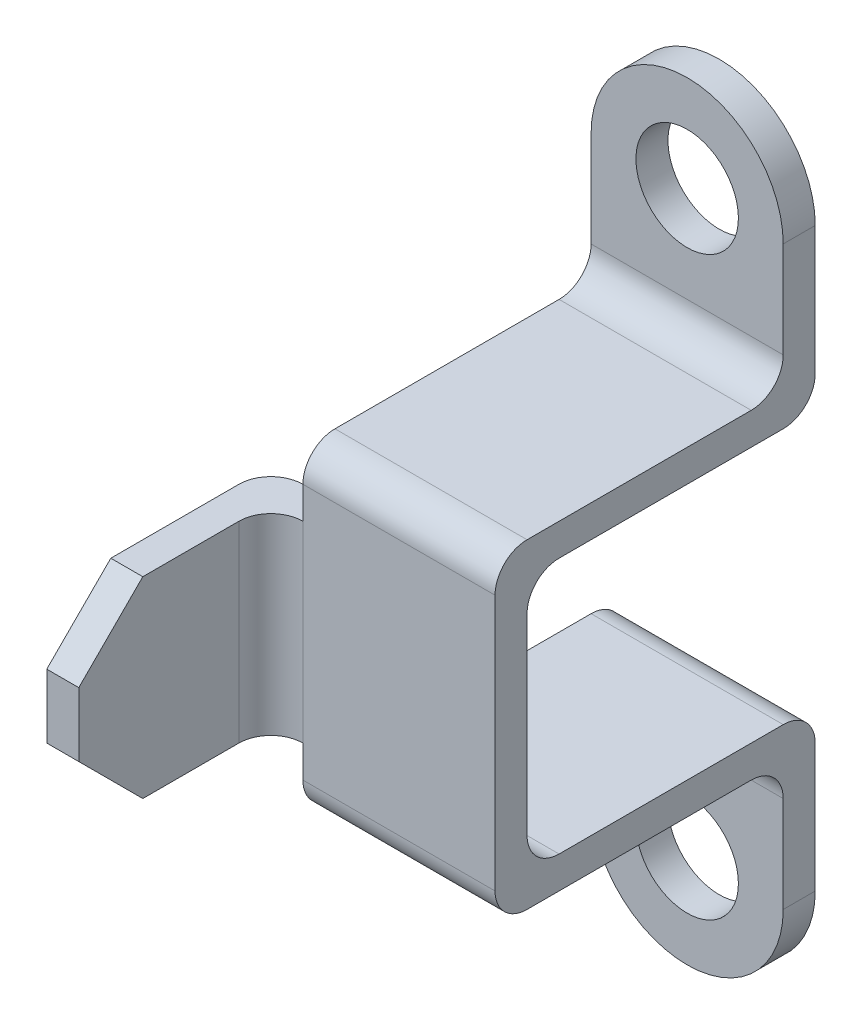
ISO-10303-21;
HEADER;
FILE_DESCRIPTION(('STEP AP214'),'2;1');
FILE_NAME('part.step','',(''),(''),'','','');
FILE_SCHEMA(('AUTOMOTIVE_DESIGN { 1 0 10303 214 1 1 1 1 }'));
ENDSEC;
DATA;
#1=APPLICATION_CONTEXT('core data for automotive mechanical design processes');
#2=APPLICATION_PROTOCOL_DEFINITION('international standard','automotive_design',2000,#1);
#3=PRODUCT_CONTEXT('',#1,'mechanical');
#4=PRODUCT('Part','Part','',(#3));
#5=PRODUCT_RELATED_PRODUCT_CATEGORY('part','',(#4));
#6=PRODUCT_DEFINITION_FORMATION('','',#4);
#7=PRODUCT_DEFINITION_CONTEXT('part definition',#1,'design');
#8=PRODUCT_DEFINITION('design','',#6,#7);
#9=PRODUCT_DEFINITION_SHAPE('','',#8);
#10=(LENGTH_UNIT() NAMED_UNIT(*) SI_UNIT(.MILLI.,.METRE.));
#11=(NAMED_UNIT(*) PLANE_ANGLE_UNIT() SI_UNIT($,.RADIAN.));
#12=(NAMED_UNIT(*) SI_UNIT($,.STERADIAN.) SOLID_ANGLE_UNIT());
#13=UNCERTAINTY_MEASURE_WITH_UNIT(LENGTH_MEASURE(1.E-05),#10,'distance_accuracy_value','');
#14=(GEOMETRIC_REPRESENTATION_CONTEXT(3) GLOBAL_UNCERTAINTY_ASSIGNED_CONTEXT((#13)) GLOBAL_UNIT_ASSIGNED_CONTEXT((#10,
#11,#12)) REPRESENTATION_CONTEXT('',''));
#15=CARTESIAN_POINT('',(0.,0.,0.));
#16=DIRECTION('',(0.,0.,1.));
#17=DIRECTION('',(1.,0.,0.));
#18=AXIS2_PLACEMENT_3D('',#15,#16,#17);
#19=CARTESIAN_POINT('',(-15.,0.,0.));
#20=DIRECTION('',(1.,0.,0.));
#21=DIRECTION('',(0.,0.,-1.));
#22=AXIS2_PLACEMENT_3D('',#19,#20,#21);
#23=PLANE('',#22);
#24=DIRECTION('',(0.,0.,-1.));
#25=VECTOR('',#24,1.);
#26=CARTESIAN_POINT('',(-15.,15.,50.));
#27=LINE('',#26,#25);
#28=CARTESIAN_POINT('',(-15.,15.,50.));
#29=VERTEX_POINT('',#28);
#30=CARTESIAN_POINT('',(-15.,15.,45.));
#31=VERTEX_POINT('',#30);
#32=EDGE_CURVE('E348',#29,#31,#27,.T.);
#33=ORIENTED_EDGE('',*,*,#32,.F.);
#34=DIRECTION('',(0.,-1.,0.));
#35=VECTOR('',#34,1.);
#36=CARTESIAN_POINT('',(-15.,25.,50.));
#37=LINE('',#36,#35);
#38=CARTESIAN_POINT('',(-15.,20.,50.));
#39=VERTEX_POINT('',#38);
#40=EDGE_CURVE('E389',#39,#29,#37,.T.);
#41=ORIENTED_EDGE('',*,*,#40,.F.);
#42=CARTESIAN_POINT('',(-15.,20.,45.));
#43=DIRECTION('',(1.,0.,0.));
#44=DIRECTION('',(0.,0.,-1.));
#45=AXIS2_PLACEMENT_3D('',#42,#43,#44);
#46=CIRCLE('',#45,5.);
#47=CARTESIAN_POINT('',(-15.,25.,45.));
#48=VERTEX_POINT('',#47);
#49=EDGE_CURVE('E414',#39,#48,#46,.F.);
#50=ORIENTED_EDGE('',*,*,#49,.T.);
#51=DIRECTION('',(0.,0.,1.));
#52=VECTOR('',#51,1.);
#53=CARTESIAN_POINT('',(-15.,25.,5.));
#54=LINE('',#53,#52);
#55=CARTESIAN_POINT('',(-15.,25.,10.));
#56=VERTEX_POINT('',#55);
#57=EDGE_CURVE('E386',#56,#48,#54,.T.);
#58=ORIENTED_EDGE('',*,*,#57,.F.);
#59=CARTESIAN_POINT('',(-15.,30.,10.));
#60=DIRECTION('',(1.,0.,0.));
#61=DIRECTION('',(0.,0.,-1.));
#62=AXIS2_PLACEMENT_3D('',#59,#60,#61);
#63=CIRCLE('',#62,5.);
#64=CARTESIAN_POINT('',(-15.,30.,5.));
#65=VERTEX_POINT('',#64);
#66=EDGE_CURVE('E398',#56,#65,#63,.T.);
#67=ORIENTED_EDGE('',*,*,#66,.T.);
#68=DIRECTION('',(0.,-1.,0.));
#69=VECTOR('',#68,1.);
#70=CARTESIAN_POINT('',(-15.,45.,5.));
#71=LINE('',#70,#69);
#72=CARTESIAN_POINT('',(-15.,45.,4.99999999999999));
#73=VERTEX_POINT('',#72);
#74=EDGE_CURVE('E383',#73,#65,#71,.T.);
#75=ORIENTED_EDGE('',*,*,#74,.F.);
#76=DIRECTION('',(0.,0.,1.));
#77=VECTOR('',#76,1.);
#78=CARTESIAN_POINT('',(-15.,45.,0.));
#79=LINE('',#78,#77);
#80=CARTESIAN_POINT('',(-15.,45.,0.));
#81=VERTEX_POINT('',#80);
#82=EDGE_CURVE('E381',#81,#73,#79,.T.);
#83=ORIENTED_EDGE('',*,*,#82,.F.);
#84=DIRECTION('',(0.,1.,0.));
#85=VECTOR('',#84,1.);
#86=CARTESIAN_POINT('',(-15.,20.,0.));
#87=LINE('',#86,#85);
#88=CARTESIAN_POINT('',(-15.,25.,0.));
#89=VERTEX_POINT('',#88);
#90=EDGE_CURVE('E356',#89,#81,#87,.T.);
#91=ORIENTED_EDGE('',*,*,#90,.F.);
#92=CARTESIAN_POINT('',(-15.,25.,5.));
#93=DIRECTION('',(1.,0.,0.));
#94=DIRECTION('',(0.,0.,-1.));
#95=AXIS2_PLACEMENT_3D('',#92,#93,#94);
#96=CIRCLE('',#95,5.);
#97=CARTESIAN_POINT('',(-15.,20.,5.00000000000001));
#98=VERTEX_POINT('',#97);
#99=EDGE_CURVE('E412',#89,#98,#96,.F.);
#100=ORIENTED_EDGE('',*,*,#99,.T.);
#101=DIRECTION('',(0.,0.,-1.));
#102=VECTOR('',#101,1.);
#103=CARTESIAN_POINT('',(-15.,20.,45.));
#104=LINE('',#103,#102);
#105=CARTESIAN_POINT('',(-15.,20.,40.));
#106=VERTEX_POINT('',#105);
#107=EDGE_CURVE('E361',#106,#98,#104,.T.);
#108=ORIENTED_EDGE('',*,*,#107,.F.);
#109=CARTESIAN_POINT('',(-15.,15.,40.));
#110=DIRECTION('',(1.,0.,0.));
#111=DIRECTION('',(0.,0.,-1.));
#112=AXIS2_PLACEMENT_3D('',#109,#110,#111);
#113=CIRCLE('',#112,5.);
#114=EDGE_CURVE('E425',#106,#31,#113,.T.);
#115=ORIENTED_EDGE('',*,*,#114,.T.);
#116=EDGE_LOOP('',(#33,#41,#50,#58,#67,#75,#83,#91,#100,#108,#115));
#117=FACE_BOUND('',#116,.T.);
#118=ADVANCED_FACE('F45',(#117),#23,.F.);
#119=CARTESIAN_POINT('',(15.,20.,0.));
#120=DIRECTION('',(0.,0.,1.));
#121=DIRECTION('',(1.,0.,0.));
#122=AXIS2_PLACEMENT_3D('',#119,#120,#121);
#123=PLANE('',#122);
#124=CARTESIAN_POINT('',(0.,45.,0.));
#125=DIRECTION('',(0.,0.,1.));
#126=DIRECTION('',(1.,0.,0.));
#127=AXIS2_PLACEMENT_3D('',#124,#125,#126);
#128=CIRCLE('',#127,8.);
#129=CARTESIAN_POINT('',(8.,45.,0.));
#130=VERTEX_POINT('',#129);
#131=EDGE_CURVE('E332',#130,#130,#128,.T.);
#132=ORIENTED_EDGE('',*,*,#131,.T.);
#133=EDGE_LOOP('',(#132));
#134=FACE_BOUND('',#133,.T.);
#135=DIRECTION('',(0.,1.,0.));
#136=VECTOR('',#135,1.);
#137=CARTESIAN_POINT('',(15.,20.,0.));
#138=LINE('',#137,#136);
#139=CARTESIAN_POINT('',(15.,25.,0.));
#140=VERTEX_POINT('',#139);
#141=CARTESIAN_POINT('',(15.,45.,0.));
#142=VERTEX_POINT('',#141);
#143=EDGE_CURVE('E357',#140,#142,#138,.T.);
#144=ORIENTED_EDGE('',*,*,#143,.F.);
#145=DIRECTION('',(-1.,0.,0.));
#146=VECTOR('',#145,1.);
#147=CARTESIAN_POINT('',(15.,25.,0.));
#148=LINE('',#147,#146);
#149=EDGE_CURVE('E422',#140,#89,#148,.T.);
#150=ORIENTED_EDGE('',*,*,#149,.T.);
#151=ORIENTED_EDGE('',*,*,#90,.T.);
#152=CARTESIAN_POINT('',(0.,45.,0.));
#153=DIRECTION('',(0.,0.,1.));
#154=DIRECTION('',(-1.,0.,0.));
#155=AXIS2_PLACEMENT_3D('',#152,#153,#154);
#156=CIRCLE('',#155,15.);
#157=EDGE_CURVE('E338',#142,#81,#156,.T.);
#158=ORIENTED_EDGE('',*,*,#157,.F.);
#159=EDGE_LOOP('',(#144,#150,#151,#158));
#160=FACE_BOUND('',#159,.T.);
#161=ADVANCED_FACE('F499',(#134,#160),#123,.F.);
#162=CARTESIAN_POINT('',(15.,45.,5.));
#163=DIRECTION('',(0.,0.,-1.));
#164=DIRECTION('',(0.,1.,0.));
#165=AXIS2_PLACEMENT_3D('',#162,#163,#164);
#166=PLANE('',#165);
#167=CARTESIAN_POINT('',(0.,45.,4.99999999999999));
#168=DIRECTION('',(0.,0.,1.));
#169=DIRECTION('',(1.,0.,0.));
#170=AXIS2_PLACEMENT_3D('',#167,#168,#169);
#171=CIRCLE('',#170,8.);
#172=CARTESIAN_POINT('',(8.,45.,4.99999999999999));
#173=VERTEX_POINT('',#172);
#174=EDGE_CURVE('E331',#173,#173,#171,.T.);
#175=ORIENTED_EDGE('',*,*,#174,.F.);
#176=EDGE_LOOP('',(#175));
#177=FACE_BOUND('',#176,.T.);
#178=ORIENTED_EDGE('',*,*,#74,.T.);
#179=DIRECTION('',(-1.,0.,0.));
#180=VECTOR('',#179,1.);
#181=CARTESIAN_POINT('',(15.,30.,5.));
#182=LINE('',#181,#180);
#183=CARTESIAN_POINT('',(15.,30.,5.));
#184=VERTEX_POINT('',#183);
#185=EDGE_CURVE('E396',#65,#184,#182,.F.);
#186=ORIENTED_EDGE('',*,*,#185,.T.);
#187=DIRECTION('',(0.,-1.,0.));
#188=VECTOR('',#187,1.);
#189=CARTESIAN_POINT('',(15.,45.,5.));
#190=LINE('',#189,#188);
#191=CARTESIAN_POINT('',(15.,45.,5.));
#192=VERTEX_POINT('',#191);
#193=EDGE_CURVE('E364',#192,#184,#190,.T.);
#194=ORIENTED_EDGE('',*,*,#193,.F.);
#195=CARTESIAN_POINT('',(0.,45.,4.99999999999999));
#196=DIRECTION('',(0.,0.,1.));
#197=DIRECTION('',(-1.,0.,0.));
#198=AXIS2_PLACEMENT_3D('',#195,#196,#197);
#199=CIRCLE('',#198,15.);
#200=EDGE_CURVE('E335',#192,#73,#199,.T.);
#201=ORIENTED_EDGE('',*,*,#200,.T.);
#202=EDGE_LOOP('',(#178,#186,#194,#201));
#203=FACE_BOUND('',#202,.T.);
#204=ADVANCED_FACE('F488',(#177,#203),#166,.F.);
#205=CARTESIAN_POINT('',(15.,25.,5.));
#206=DIRECTION('',(0.,-1.,0.));
#207=DIRECTION('',(0.,0.,-1.));
#208=AXIS2_PLACEMENT_3D('',#205,#206,#207);
#209=PLANE('',#208);
#210=ORIENTED_EDGE('',*,*,#57,.T.);
#211=DIRECTION('',(-1.,0.,0.));
#212=VECTOR('',#211,1.);
#213=CARTESIAN_POINT('',(15.,25.,45.));
#214=LINE('',#213,#212);
#215=CARTESIAN_POINT('',(15.,25.,45.));
#216=VERTEX_POINT('',#215);
#217=EDGE_CURVE('E416',#48,#216,#214,.F.);
#218=ORIENTED_EDGE('',*,*,#217,.T.);
#219=DIRECTION('',(0.,0.,1.));
#220=VECTOR('',#219,1.);
#221=CARTESIAN_POINT('',(15.,25.,5.));
#222=LINE('',#221,#220);
#223=CARTESIAN_POINT('',(15.,25.,10.));
#224=VERTEX_POINT('',#223);
#225=EDGE_CURVE('E367',#224,#216,#222,.T.);
#226=ORIENTED_EDGE('',*,*,#225,.F.);
#227=DIRECTION('',(-1.,0.,0.));
#228=VECTOR('',#227,1.);
#229=CARTESIAN_POINT('',(-15.,25.,10.));
#230=LINE('',#229,#228);
#231=EDGE_CURVE('E378',#224,#56,#230,.T.);
#232=ORIENTED_EDGE('',*,*,#231,.T.);
#233=EDGE_LOOP('',(#210,#218,#226,#232));
#234=FACE_BOUND('',#233,.T.);
#235=ADVANCED_FACE('F478',(#234),#209,.F.);
#236=CARTESIAN_POINT('',(15.,25.,50.));
#237=DIRECTION('',(0.,0.,-1.));
#238=DIRECTION('',(-1.,0.,0.));
#239=AXIS2_PLACEMENT_3D('',#236,#237,#238);
#240=PLANE('',#239);
#241=ORIENTED_EDGE('',*,*,#40,.T.);
#242=DIRECTION('',(0.,-1.,0.));
#243=VECTOR('',#242,1.);
#244=CARTESIAN_POINT('',(-15.,0.,50.));
#245=LINE('',#244,#243);
#246=CARTESIAN_POINT('',(-15.,-15.,50.));
#247=VERTEX_POINT('',#246);
#248=EDGE_CURVE('E437',#29,#247,#245,.T.);
#249=ORIENTED_EDGE('',*,*,#248,.T.);
#250=DIRECTION('',(0.,1.,0.));
#251=VECTOR('',#250,1.);
#252=CARTESIAN_POINT('',(-15.,-25.,50.));
#253=LINE('',#252,#251);
#254=CARTESIAN_POINT('',(-15.,-20.,50.));
#255=VERTEX_POINT('',#254);
#256=EDGE_CURVE('E270',#255,#247,#253,.T.);
#257=ORIENTED_EDGE('',*,*,#256,.F.);
#258=DIRECTION('',(-1.,0.,0.));
#259=VECTOR('',#258,1.);
#260=CARTESIAN_POINT('',(15.,-20.,50.));
#261=LINE('',#260,#259);
#262=CARTESIAN_POINT('',(15.,-20.,50.));
#263=VERTEX_POINT('',#262);
#264=EDGE_CURVE('E293',#263,#255,#261,.T.);
#265=ORIENTED_EDGE('',*,*,#264,.F.);
#266=DIRECTION('',(0.,-1.,0.));
#267=VECTOR('',#266,1.);
#268=CARTESIAN_POINT('',(15.,25.,50.));
#269=LINE('',#268,#267);
#270=CARTESIAN_POINT('',(15.,20.,50.));
#271=VERTEX_POINT('',#270);
#272=EDGE_CURVE('E370',#271,#263,#269,.T.);
#273=ORIENTED_EDGE('',*,*,#272,.F.);
#274=DIRECTION('',(-1.,0.,0.));
#275=VECTOR('',#274,1.);
#276=CARTESIAN_POINT('',(15.,20.,50.));
#277=LINE('',#276,#275);
#278=EDGE_CURVE('E409',#271,#39,#277,.T.);
#279=ORIENTED_EDGE('',*,*,#278,.T.);
#280=EDGE_LOOP('',(#241,#249,#257,#265,#273,#279));
#281=FACE_BOUND('',#280,.T.);
#282=ADVANCED_FACE('F467',(#281),#240,.F.);
#283=CARTESIAN_POINT('',(15.,0.,45.));
#284=DIRECTION('',(0.,0.,1.));
#285=DIRECTION('',(1.,0.,0.));
#286=AXIS2_PLACEMENT_3D('',#283,#284,#285);
#287=PLANE('',#286);
#288=DIRECTION('',(0.,1.,0.));
#289=VECTOR('',#288,1.);
#290=CARTESIAN_POINT('',(15.,0.,45.));
#291=LINE('',#290,#289);
#292=CARTESIAN_POINT('',(15.,-15.,45.));
#293=VERTEX_POINT('',#292);
#294=CARTESIAN_POINT('',(15.,15.,45.));
#295=VERTEX_POINT('',#294);
#296=EDGE_CURVE('E372',#293,#295,#291,.T.);
#297=ORIENTED_EDGE('',*,*,#296,.F.);
#298=DIRECTION('',(-1.,0.,0.));
#299=VECTOR('',#298,1.);
#300=CARTESIAN_POINT('',(15.,-15.,45.));
#301=LINE('',#300,#299);
#302=CARTESIAN_POINT('',(-15.,-15.,45.));
#303=VERTEX_POINT('',#302);
#304=EDGE_CURVE('E290',#303,#293,#301,.F.);
#305=ORIENTED_EDGE('',*,*,#304,.F.);
#306=DIRECTION('',(-1.,0.,0.));
#307=VECTOR('',#306,1.);
#308=CARTESIAN_POINT('',(-15.,-15.,45.));
#309=LINE('',#308,#307);
#310=CARTESIAN_POINT('',(-20.,-15.,45.));
#311=VERTEX_POINT('',#310);
#312=EDGE_CURVE('E257',#303,#311,#309,.T.);
#313=ORIENTED_EDGE('',*,*,#312,.T.);
#314=DIRECTION('',(0.,-1.,0.));
#315=VECTOR('',#314,1.);
#316=CARTESIAN_POINT('',(-20.,15.,45.));
#317=LINE('',#316,#315);
#318=CARTESIAN_POINT('',(-20.,15.,45.));
#319=VERTEX_POINT('',#318);
#320=EDGE_CURVE('E432',#311,#319,#317,.F.);
#321=ORIENTED_EDGE('',*,*,#320,.T.);
#322=DIRECTION('',(-1.,0.,0.));
#323=VECTOR('',#322,1.);
#324=CARTESIAN_POINT('',(-15.,15.,45.));
#325=LINE('',#324,#323);
#326=EDGE_CURVE('E353',#31,#319,#325,.T.);
#327=ORIENTED_EDGE('',*,*,#326,.F.);
#328=DIRECTION('',(-1.,0.,0.));
#329=VECTOR('',#328,1.);
#330=CARTESIAN_POINT('',(15.,15.,45.));
#331=LINE('',#330,#329);
#332=EDGE_CURVE('E407',#31,#295,#331,.F.);
#333=ORIENTED_EDGE('',*,*,#332,.T.);
#334=EDGE_LOOP('',(#297,#305,#313,#321,#327,#333));
#335=FACE_BOUND('',#334,.T.);
#336=ADVANCED_FACE('F512',(#335),#287,.F.);
#337=CARTESIAN_POINT('',(15.,20.,45.));
#338=DIRECTION('',(0.,1.,0.));
#339=DIRECTION('',(0.,0.,1.));
#340=AXIS2_PLACEMENT_3D('',#337,#338,#339);
#341=PLANE('',#340);
#342=DIRECTION('',(0.,0.,-1.));
#343=VECTOR('',#342,1.);
#344=CARTESIAN_POINT('',(15.,20.,45.));
#345=LINE('',#344,#343);
#346=CARTESIAN_POINT('',(15.,20.,40.));
#347=VERTEX_POINT('',#346);
#348=CARTESIAN_POINT('',(15.,20.,5.00000000000001));
#349=VERTEX_POINT('',#348);
#350=EDGE_CURVE('E375',#347,#349,#345,.T.);
#351=ORIENTED_EDGE('',*,*,#350,.F.);
#352=DIRECTION('',(-1.,0.,0.));
#353=VECTOR('',#352,1.);
#354=CARTESIAN_POINT('',(-15.,20.,40.));
#355=LINE('',#354,#353);
#356=EDGE_CURVE('E404',#347,#106,#355,.T.);
#357=ORIENTED_EDGE('',*,*,#356,.T.);
#358=ORIENTED_EDGE('',*,*,#107,.T.);
#359=DIRECTION('',(-1.,0.,0.));
#360=VECTOR('',#359,1.);
#361=CARTESIAN_POINT('',(15.,20.,5.));
#362=LINE('',#361,#360);
#363=EDGE_CURVE('E402',#98,#349,#362,.F.);
#364=ORIENTED_EDGE('',*,*,#363,.T.);
#365=EDGE_LOOP('',(#351,#357,#358,#364));
#366=FACE_BOUND('',#365,.T.);
#367=ADVANCED_FACE('F506',(#366),#341,.F.);
#368=CARTESIAN_POINT('',(15.,0.,0.));
#369=DIRECTION('',(1.,0.,0.));
#370=DIRECTION('',(0.,0.,-1.));
#371=AXIS2_PLACEMENT_3D('',#368,#369,#370);
#372=PLANE('',#371);
#373=ORIENTED_EDGE('',*,*,#225,.T.);
#374=CARTESIAN_POINT('',(15.,20.,45.));
#375=DIRECTION('',(1.,0.,0.));
#376=DIRECTION('',(0.,0.,-1.));
#377=AXIS2_PLACEMENT_3D('',#374,#375,#376);
#378=CIRCLE('',#377,5.);
#379=EDGE_CURVE('E420',#216,#271,#378,.T.);
#380=ORIENTED_EDGE('',*,*,#379,.T.);
#381=ORIENTED_EDGE('',*,*,#272,.T.);
#382=CARTESIAN_POINT('',(15.,-20.,45.));
#383=DIRECTION('',(-1.,0.,0.));
#384=DIRECTION('',(0.,0.,-1.));
#385=AXIS2_PLACEMENT_3D('',#382,#383,#384);
#386=CIRCLE('',#385,5.);
#387=CARTESIAN_POINT('',(15.,-25.,45.));
#388=VERTEX_POINT('',#387);
#389=EDGE_CURVE('E304',#388,#263,#386,.T.);
#390=ORIENTED_EDGE('',*,*,#389,.F.);
#391=DIRECTION('',(0.,0.,1.));
#392=VECTOR('',#391,1.);
#393=CARTESIAN_POINT('',(15.,-25.,4.99999999999999));
#394=LINE('',#393,#392);
#395=CARTESIAN_POINT('',(15.,-25.,9.99999999999999));
#396=VERTEX_POINT('',#395);
#397=EDGE_CURVE('E907',#396,#388,#394,.T.);
#398=ORIENTED_EDGE('',*,*,#397,.F.);
#399=CARTESIAN_POINT('',(15.,-30.,9.99999999999999));
#400=DIRECTION('',(-1.,0.,0.));
#401=DIRECTION('',(0.,0.,-1.));
#402=AXIS2_PLACEMENT_3D('',#399,#400,#401);
#403=CIRCLE('',#402,5.);
#404=CARTESIAN_POINT('',(15.,-30.,4.99999999999999));
#405=VERTEX_POINT('',#404);
#406=EDGE_CURVE('E283',#405,#396,#403,.F.);
#407=ORIENTED_EDGE('',*,*,#406,.F.);
#408=DIRECTION('',(0.,1.,0.));
#409=VECTOR('',#408,1.);
#410=CARTESIAN_POINT('',(15.,-45.,4.99999999999999));
#411=LINE('',#410,#409);
#412=CARTESIAN_POINT('',(15.,-45.,4.99999999999999));
#413=VERTEX_POINT('',#412);
#414=EDGE_CURVE('E905',#413,#405,#411,.T.);
#415=ORIENTED_EDGE('',*,*,#414,.F.);
#416=DIRECTION('',(0.,0.,1.));
#417=VECTOR('',#416,1.);
#418=CARTESIAN_POINT('',(15.,-45.,0.));
#419=LINE('',#418,#417);
#420=CARTESIAN_POINT('',(15.,-45.,0.));
#421=VERTEX_POINT('',#420);
#422=EDGE_CURVE('E903',#421,#413,#419,.T.);
#423=ORIENTED_EDGE('',*,*,#422,.F.);
#424=DIRECTION('',(0.,-1.,0.));
#425=VECTOR('',#424,1.);
#426=CARTESIAN_POINT('',(15.,-20.,0.));
#427=LINE('',#426,#425);
#428=CARTESIAN_POINT('',(15.,-25.,0.));
#429=VERTEX_POINT('',#428);
#430=EDGE_CURVE('E238',#429,#421,#427,.T.);
#431=ORIENTED_EDGE('',*,*,#430,.F.);
#432=CARTESIAN_POINT('',(15.,-25.,4.99999999999999));
#433=DIRECTION('',(-1.,0.,0.));
#434=DIRECTION('',(0.,0.,-1.));
#435=AXIS2_PLACEMENT_3D('',#432,#433,#434);
#436=CIRCLE('',#435,5.);
#437=CARTESIAN_POINT('',(15.,-20.,5.00000000000001));
#438=VERTEX_POINT('',#437);
#439=EDGE_CURVE('E302',#438,#429,#436,.T.);
#440=ORIENTED_EDGE('',*,*,#439,.F.);
#441=DIRECTION('',(0.,0.,-1.));
#442=VECTOR('',#441,1.);
#443=CARTESIAN_POINT('',(15.,-20.,45.));
#444=LINE('',#443,#442);
#445=CARTESIAN_POINT('',(15.,-20.,40.));
#446=VERTEX_POINT('',#445);
#447=EDGE_CURVE('E263',#446,#438,#444,.T.);
#448=ORIENTED_EDGE('',*,*,#447,.F.);
#449=CARTESIAN_POINT('',(15.,-15.,40.));
#450=DIRECTION('',(-1.,0.,0.));
#451=DIRECTION('',(0.,0.,-1.));
#452=AXIS2_PLACEMENT_3D('',#449,#450,#451);
#453=CIRCLE('',#452,5.);
#454=EDGE_CURVE('E312',#293,#446,#453,.F.);
#455=ORIENTED_EDGE('',*,*,#454,.F.);
#456=ORIENTED_EDGE('',*,*,#296,.T.);
#457=CARTESIAN_POINT('',(15.,15.,40.));
#458=DIRECTION('',(1.,0.,0.));
#459=DIRECTION('',(0.,0.,-1.));
#460=AXIS2_PLACEMENT_3D('',#457,#458,#459);
#461=CIRCLE('',#460,5.);
#462=EDGE_CURVE('E428',#295,#347,#461,.F.);
#463=ORIENTED_EDGE('',*,*,#462,.T.);
#464=ORIENTED_EDGE('',*,*,#350,.T.);
#465=CARTESIAN_POINT('',(15.,25.,5.));
#466=DIRECTION('',(1.,0.,0.));
#467=DIRECTION('',(0.,0.,-1.));
#468=AXIS2_PLACEMENT_3D('',#465,#466,#467);
#469=CIRCLE('',#468,5.);
#470=EDGE_CURVE('E418',#349,#140,#469,.T.);
#471=ORIENTED_EDGE('',*,*,#470,.T.);
#472=ORIENTED_EDGE('',*,*,#143,.T.);
#473=DIRECTION('',(0.,0.,1.));
#474=VECTOR('',#473,1.);
#475=CARTESIAN_POINT('',(15.,45.,0.));
#476=LINE('',#475,#474);
#477=EDGE_CURVE('E360',#142,#192,#476,.T.);
#478=ORIENTED_EDGE('',*,*,#477,.T.);
#479=ORIENTED_EDGE('',*,*,#193,.T.);
#480=CARTESIAN_POINT('',(15.,30.,10.));
#481=DIRECTION('',(1.,0.,0.));
#482=DIRECTION('',(0.,0.,-1.));
#483=AXIS2_PLACEMENT_3D('',#480,#481,#482);
#484=CIRCLE('',#483,5.);
#485=EDGE_CURVE('E400',#184,#224,#484,.F.);
#486=ORIENTED_EDGE('',*,*,#485,.T.);
#487=EDGE_LOOP('',(#373,#380,#381,#390,#398,#407,#415,#423,#431,#440,#448,#455,#456,#463,#464,
#471,#472,#478,#479,#486));
#488=FACE_BOUND('',#487,.T.);
#489=ADVANCED_FACE('F494',(#488),#372,.T.);
#490=CARTESIAN_POINT('',(15.,30.,10.));
#491=DIRECTION('',(1.,0.,0.));
#492=DIRECTION('',(0.,0.,-1.));
#493=AXIS2_PLACEMENT_3D('',#490,#491,#492);
#494=CYLINDRICAL_SURFACE('',#493,5.);
#495=ORIENTED_EDGE('',*,*,#485,.F.);
#496=ORIENTED_EDGE('',*,*,#185,.F.);
#497=ORIENTED_EDGE('',*,*,#66,.F.);
#498=ORIENTED_EDGE('',*,*,#231,.F.);
#499=EDGE_LOOP('',(#495,#496,#497,#498));
#500=FACE_BOUND('',#499,.T.);
#501=ADVANCED_FACE('F483',(#500),#494,.F.);
#502=CARTESIAN_POINT('',(15.,15.,40.));
#503=DIRECTION('',(1.,0.,0.));
#504=DIRECTION('',(0.,0.,-1.));
#505=AXIS2_PLACEMENT_3D('',#502,#503,#504);
#506=CYLINDRICAL_SURFACE('',#505,5.);
#507=ORIENTED_EDGE('',*,*,#462,.F.);
#508=ORIENTED_EDGE('',*,*,#332,.F.);
#509=ORIENTED_EDGE('',*,*,#114,.F.);
#510=ORIENTED_EDGE('',*,*,#356,.F.);
#511=EDGE_LOOP('',(#507,#508,#509,#510));
#512=FACE_BOUND('',#511,.T.);
#513=ADVANCED_FACE('F510',(#512),#506,.F.);
#514=CARTESIAN_POINT('',(15.,20.,45.));
#515=DIRECTION('',(-1.,0.,0.));
#516=DIRECTION('',(0.,0.,1.));
#517=AXIS2_PLACEMENT_3D('',#514,#515,#516);
#518=CYLINDRICAL_SURFACE('',#517,5.);
#519=ORIENTED_EDGE('',*,*,#379,.F.);
#520=ORIENTED_EDGE('',*,*,#217,.F.);
#521=ORIENTED_EDGE('',*,*,#49,.F.);
#522=ORIENTED_EDGE('',*,*,#278,.F.);
#523=EDGE_LOOP('',(#519,#520,#521,#522));
#524=FACE_BOUND('',#523,.T.);
#525=ADVANCED_FACE('F474',(#524),#518,.T.);
#526=CARTESIAN_POINT('',(15.,25.,5.));
#527=DIRECTION('',(-1.,0.,0.));
#528=DIRECTION('',(0.,0.,1.));
#529=AXIS2_PLACEMENT_3D('',#526,#527,#528);
#530=CYLINDRICAL_SURFACE('',#529,5.);
#531=ORIENTED_EDGE('',*,*,#470,.F.);
#532=ORIENTED_EDGE('',*,*,#363,.F.);
#533=ORIENTED_EDGE('',*,*,#99,.F.);
#534=ORIENTED_EDGE('',*,*,#149,.F.);
#535=EDGE_LOOP('',(#531,#532,#533,#534));
#536=FACE_BOUND('',#535,.T.);
#537=ADVANCED_FACE('F502',(#536),#530,.T.);
#538=CARTESIAN_POINT('',(0.,15.,0.));
#539=DIRECTION('',(0.,1.,0.));
#540=DIRECTION('',(0.,0.,1.));
#541=AXIS2_PLACEMENT_3D('',#538,#539,#540);
#542=PLANE('',#541);
#543=DIRECTION('',(0.,0.,-1.));
#544=VECTOR('',#543,1.);
#545=CARTESIAN_POINT('',(-25.,15.,45.));
#546=LINE('',#545,#544);
#547=CARTESIAN_POINT('',(-25.,15.,70.));
#548=VERTEX_POINT('',#547);
#549=CARTESIAN_POINT('',(-25.,15.,50.));
#550=VERTEX_POINT('',#549);
#551=EDGE_CURVE('E345',#548,#550,#546,.T.);
#552=ORIENTED_EDGE('',*,*,#551,.F.);
#553=DIRECTION('',(1.,0.,0.));
#554=VECTOR('',#553,1.);
#555=CARTESIAN_POINT('',(-20.,15.,70.));
#556=LINE('',#555,#554);
#557=CARTESIAN_POINT('',(-20.,15.,70.));
#558=VERTEX_POINT('',#557);
#559=EDGE_CURVE('E444',#548,#558,#556,.T.);
#560=ORIENTED_EDGE('',*,*,#559,.T.);
#561=DIRECTION('',(0.,0.,-1.));
#562=VECTOR('',#561,1.);
#563=CARTESIAN_POINT('',(-20.,15.,45.));
#564=LINE('',#563,#562);
#565=CARTESIAN_POINT('',(-20.,15.,55.));
#566=VERTEX_POINT('',#565);
#567=EDGE_CURVE('E346',#558,#566,#564,.T.);
#568=ORIENTED_EDGE('',*,*,#567,.T.);
#569=CARTESIAN_POINT('',(-15.,15.,55.));
#570=DIRECTION('',(0.,1.,0.));
#571=DIRECTION('',(0.,0.,1.));
#572=AXIS2_PLACEMENT_3D('',#569,#570,#571);
#573=CIRCLE('',#572,5.);
#574=EDGE_CURVE('E442',#566,#29,#573,.F.);
#575=ORIENTED_EDGE('',*,*,#574,.T.);
#576=ORIENTED_EDGE('',*,*,#32,.T.);
#577=ORIENTED_EDGE('',*,*,#326,.T.);
#578=CARTESIAN_POINT('',(-20.,15.,50.));
#579=DIRECTION('',(0.,1.,0.));
#580=DIRECTION('',(0.,0.,1.));
#581=AXIS2_PLACEMENT_3D('',#578,#579,#580);
#582=CIRCLE('',#581,5.);
#583=EDGE_CURVE('E434',#319,#550,#582,.T.);
#584=ORIENTED_EDGE('',*,*,#583,.T.);
#585=EDGE_LOOP('',(#552,#560,#568,#575,#576,#577,#584));
#586=FACE_BOUND('',#585,.T.);
#587=ADVANCED_FACE('F450',(#586),#542,.T.);
#588=CARTESIAN_POINT('',(-25.,0.,80.));
#589=DIRECTION('',(0.,0.,-1.));
#590=DIRECTION('',(-1.,0.,0.));
#591=AXIS2_PLACEMENT_3D('',#588,#589,#590);
#592=PLANE('',#591);
#593=DIRECTION('',(0.,1.,0.));
#594=VECTOR('',#593,1.);
#595=CARTESIAN_POINT('',(-20.,0.,80.));
#596=LINE('',#595,#594);
#597=CARTESIAN_POINT('',(-20.,-4.99999999999998,80.));
#598=VERTEX_POINT('',#597);
#599=CARTESIAN_POINT('',(-20.,4.99999999999996,80.));
#600=VERTEX_POINT('',#599);
#601=EDGE_CURVE('E340',#598,#600,#596,.T.);
#602=ORIENTED_EDGE('',*,*,#601,.T.);
#603=DIRECTION('',(-1.,0.,0.));
#604=VECTOR('',#603,1.);
#605=CARTESIAN_POINT('',(-25.,4.99999999999996,80.));
#606=LINE('',#605,#604);
#607=CARTESIAN_POINT('',(-25.,4.99999999999996,80.));
#608=VERTEX_POINT('',#607);
#609=EDGE_CURVE('E54',#600,#608,#606,.T.);
#610=ORIENTED_EDGE('',*,*,#609,.T.);
#611=DIRECTION('',(0.,1.,0.));
#612=VECTOR('',#611,1.);
#613=CARTESIAN_POINT('',(-25.,0.,80.));
#614=LINE('',#613,#612);
#615=CARTESIAN_POINT('',(-25.,-4.99999999999998,80.));
#616=VERTEX_POINT('',#615);
#617=EDGE_CURVE('E343',#616,#608,#614,.T.);
#618=ORIENTED_EDGE('',*,*,#617,.F.);
#619=DIRECTION('',(-1.,0.,0.));
#620=VECTOR('',#619,1.);
#621=CARTESIAN_POINT('',(-25.,-4.99999999999998,80.));
#622=LINE('',#621,#620);
#623=EDGE_CURVE('E326',#598,#616,#622,.T.);
#624=ORIENTED_EDGE('',*,*,#623,.F.);
#625=EDGE_LOOP('',(#602,#610,#618,#624));
#626=FACE_BOUND('',#625,.T.);
#627=ADVANCED_FACE('F583',(#626),#592,.F.);
#628=CARTESIAN_POINT('',(-25.,0.,0.));
#629=DIRECTION('',(-1.,0.,0.));
#630=DIRECTION('',(0.,0.,1.));
#631=AXIS2_PLACEMENT_3D('',#628,#629,#630);
#632=PLANE('',#631);
#633=ORIENTED_EDGE('',*,*,#617,.T.);
#634=DIRECTION('',(0.,0.70710678118655,-0.707106781186546));
#635=VECTOR('',#634,1.);
#636=CARTESIAN_POINT('',(-25.,42.5,42.5000000000002));
#637=LINE('',#636,#635);
#638=EDGE_CURVE('E11',#608,#548,#637,.T.);
#639=ORIENTED_EDGE('',*,*,#638,.T.);
#640=ORIENTED_EDGE('',*,*,#551,.T.);
#641=DIRECTION('',(0.,-1.,0.));
#642=VECTOR('',#641,1.);
#643=CARTESIAN_POINT('',(-25.,0.,50.));
#644=LINE('',#643,#642);
#645=CARTESIAN_POINT('',(-25.,-15.,50.));
#646=VERTEX_POINT('',#645);
#647=EDGE_CURVE('E430',#550,#646,#644,.T.);
#648=ORIENTED_EDGE('',*,*,#647,.T.);
#649=DIRECTION('',(0.,0.,-1.));
#650=VECTOR('',#649,1.);
#651=CARTESIAN_POINT('',(-25.,-15.,45.));
#652=LINE('',#651,#650);
#653=CARTESIAN_POINT('',(-25.,-15.,70.));
#654=VERTEX_POINT('',#653);
#655=EDGE_CURVE('E528',#654,#646,#652,.T.);
#656=ORIENTED_EDGE('',*,*,#655,.F.);
#657=DIRECTION('',(0.,-0.707106781186549,-0.707106781186546));
#658=VECTOR('',#657,1.);
#659=CARTESIAN_POINT('',(-25.,-42.5,42.5000000000002));
#660=LINE('',#659,#658);
#661=EDGE_CURVE('E329',#616,#654,#660,.T.);
#662=ORIENTED_EDGE('',*,*,#661,.F.);
#663=EDGE_LOOP('',(#633,#639,#640,#648,#656,#662));
#664=FACE_BOUND('',#663,.T.);
#665=ADVANCED_FACE('F534',(#664),#632,.T.);
#666=CARTESIAN_POINT('',(-20.,0.,0.));
#667=DIRECTION('',(-1.,0.,0.));
#668=DIRECTION('',(0.,0.,1.));
#669=AXIS2_PLACEMENT_3D('',#666,#667,#668);
#670=PLANE('',#669);
#671=ORIENTED_EDGE('',*,*,#567,.F.);
#672=DIRECTION('',(0.,-0.70710678118655,0.707106781186546));
#673=VECTOR('',#672,1.);
#674=CARTESIAN_POINT('',(-20.,15.,70.));
#675=LINE('',#674,#673);
#676=EDGE_CURVE('E68',#558,#600,#675,.T.);
#677=ORIENTED_EDGE('',*,*,#676,.T.);
#678=ORIENTED_EDGE('',*,*,#601,.F.);
#679=DIRECTION('',(0.,0.707106781186549,0.707106781186546));
#680=VECTOR('',#679,1.);
#681=CARTESIAN_POINT('',(-20.,-15.,70.));
#682=LINE('',#681,#680);
#683=CARTESIAN_POINT('',(-20.,-15.,70.));
#684=VERTEX_POINT('',#683);
#685=EDGE_CURVE('E323',#684,#598,#682,.T.);
#686=ORIENTED_EDGE('',*,*,#685,.F.);
#687=DIRECTION('',(0.,0.,-1.));
#688=VECTOR('',#687,1.);
#689=CARTESIAN_POINT('',(-20.,-15.,45.));
#690=LINE('',#689,#688);
#691=CARTESIAN_POINT('',(-20.,-15.,55.));
#692=VERTEX_POINT('',#691);
#693=EDGE_CURVE('E240',#684,#692,#690,.T.);
#694=ORIENTED_EDGE('',*,*,#693,.T.);
#695=DIRECTION('',(0.,-1.,0.));
#696=VECTOR('',#695,1.);
#697=CARTESIAN_POINT('',(-20.,15.,55.));
#698=LINE('',#697,#696);
#699=EDGE_CURVE('E439',#692,#566,#698,.F.);
#700=ORIENTED_EDGE('',*,*,#699,.T.);
#701=EDGE_LOOP('',(#671,#677,#678,#686,#694,#700));
#702=FACE_BOUND('',#701,.T.);
#703=ADVANCED_FACE('F453',(#702),#670,.F.);
#704=CARTESIAN_POINT('',(-20.,0.,50.));
#705=DIRECTION('',(0.,1.,0.));
#706=DIRECTION('',(0.,0.,1.));
#707=AXIS2_PLACEMENT_3D('',#704,#705,#706);
#708=CYLINDRICAL_SURFACE('',#707,5.);
#709=ORIENTED_EDGE('',*,*,#583,.F.);
#710=ORIENTED_EDGE('',*,*,#320,.F.);
#711=CARTESIAN_POINT('',(-20.,-15.,50.));
#712=DIRECTION('',(0.,1.,0.));
#713=DIRECTION('',(0.,0.,1.));
#714=AXIS2_PLACEMENT_3D('',#711,#712,#713);
#715=CIRCLE('',#714,5.);
#716=EDGE_CURVE('E314',#311,#646,#715,.T.);
#717=ORIENTED_EDGE('',*,*,#716,.T.);
#718=ORIENTED_EDGE('',*,*,#647,.F.);
#719=EDGE_LOOP('',(#709,#710,#717,#718));
#720=FACE_BOUND('',#719,.T.);
#721=ADVANCED_FACE('F532',(#720),#708,.T.);
#722=CARTESIAN_POINT('',(-15.,25.,55.));
#723=DIRECTION('',(0.,1.,0.));
#724=DIRECTION('',(0.,0.,1.));
#725=AXIS2_PLACEMENT_3D('',#722,#723,#724);
#726=CYLINDRICAL_SURFACE('',#725,5.);
#727=ORIENTED_EDGE('',*,*,#574,.F.);
#728=ORIENTED_EDGE('',*,*,#699,.F.);
#729=CARTESIAN_POINT('',(-15.,-15.,55.));
#730=DIRECTION('',(0.,1.,0.));
#731=DIRECTION('',(0.,0.,1.));
#732=AXIS2_PLACEMENT_3D('',#729,#730,#731);
#733=CIRCLE('',#732,5.);
#734=EDGE_CURVE('E317',#692,#247,#733,.F.);
#735=ORIENTED_EDGE('',*,*,#734,.T.);
#736=ORIENTED_EDGE('',*,*,#248,.F.);
#737=EDGE_LOOP('',(#727,#728,#735,#736));
#738=FACE_BOUND('',#737,.T.);
#739=ADVANCED_FACE('F460',(#738),#726,.F.);
#740=CARTESIAN_POINT('',(0.,15.,70.));
#741=DIRECTION('',(0.,0.707106781186545,0.707106781186549));
#742=DIRECTION('',(-1.,0.,0.));
#743=AXIS2_PLACEMENT_3D('',#740,#741,#742);
#744=PLANE('',#743);
#745=ORIENTED_EDGE('',*,*,#638,.F.);
#746=ORIENTED_EDGE('',*,*,#609,.F.);
#747=ORIENTED_EDGE('',*,*,#676,.F.);
#748=ORIENTED_EDGE('',*,*,#559,.F.);
#749=EDGE_LOOP('',(#745,#746,#747,#748));
#750=FACE_BOUND('',#749,.T.);
#751=ADVANCED_FACE('F48',(#750),#744,.T.);
#752=CARTESIAN_POINT('',(0.,45.,0.));
#753=DIRECTION('',(0.,0.,1.));
#754=DIRECTION('',(1.,0.,0.));
#755=AXIS2_PLACEMENT_3D('',#752,#753,#754);
#756=CYLINDRICAL_SURFACE('',#755,15.);
#757=ORIENTED_EDGE('',*,*,#200,.F.);
#758=ORIENTED_EDGE('',*,*,#477,.F.);
#759=ORIENTED_EDGE('',*,*,#157,.T.);
#760=ORIENTED_EDGE('',*,*,#82,.T.);
#761=EDGE_LOOP('',(#757,#758,#759,#760));
#762=FACE_BOUND('',#761,.T.);
#763=ADVANCED_FACE('F491',(#762),#756,.T.);
#764=CARTESIAN_POINT('',(0.,45.,0.));
#765=DIRECTION('',(0.,0.,1.));
#766=DIRECTION('',(1.,0.,0.));
#767=AXIS2_PLACEMENT_3D('',#764,#765,#766);
#768=CYLINDRICAL_SURFACE('',#767,8.);
#769=ORIENTED_EDGE('',*,*,#131,.F.);
#770=EDGE_LOOP('',(#769));
#771=FACE_BOUND('',#770,.T.);
#772=ORIENTED_EDGE('',*,*,#174,.T.);
#773=EDGE_LOOP('',(#772));
#774=FACE_BOUND('',#773,.T.);
#775=ADVANCED_FACE('F540',(#771,#774),#768,.F.);
#776=CARTESIAN_POINT('',(-15.,0.,0.));
#777=DIRECTION('',(1.,0.,0.));
#778=DIRECTION('',(0.,0.,-1.));
#779=AXIS2_PLACEMENT_3D('',#776,#777,#778);
#780=PLANE('',#779);
#781=DIRECTION('',(0.,0.,-1.));
#782=VECTOR('',#781,1.);
#783=CARTESIAN_POINT('',(-15.,-15.,50.));
#784=LINE('',#783,#782);
#785=EDGE_CURVE('E260',#247,#303,#784,.T.);
#786=ORIENTED_EDGE('',*,*,#785,.T.);
#787=CARTESIAN_POINT('',(-15.,-15.,40.));
#788=DIRECTION('',(-1.,0.,0.));
#789=DIRECTION('',(0.,0.,-1.));
#790=AXIS2_PLACEMENT_3D('',#787,#788,#789);
#791=CIRCLE('',#790,5.);
#792=CARTESIAN_POINT('',(-15.,-20.,40.));
#793=VERTEX_POINT('',#792);
#794=EDGE_CURVE('E309',#793,#303,#791,.T.);
#795=ORIENTED_EDGE('',*,*,#794,.F.);
#796=DIRECTION('',(0.,0.,-1.));
#797=VECTOR('',#796,1.);
#798=CARTESIAN_POINT('',(-15.,-20.,45.));
#799=LINE('',#798,#797);
#800=CARTESIAN_POINT('',(-15.,-20.,5.00000000000001));
#801=VERTEX_POINT('',#800);
#802=EDGE_CURVE('E273',#793,#801,#799,.T.);
#803=ORIENTED_EDGE('',*,*,#802,.T.);
#804=CARTESIAN_POINT('',(-15.,-25.,4.99999999999999));
#805=DIRECTION('',(-1.,0.,0.));
#806=DIRECTION('',(0.,0.,-1.));
#807=AXIS2_PLACEMENT_3D('',#804,#805,#806);
#808=CIRCLE('',#807,5.);
#809=CARTESIAN_POINT('',(-15.,-25.,0.));
#810=VERTEX_POINT('',#809);
#811=EDGE_CURVE('E256',#810,#801,#808,.F.);
#812=ORIENTED_EDGE('',*,*,#811,.F.);
#813=DIRECTION('',(0.,-1.,0.));
#814=VECTOR('',#813,1.);
#815=CARTESIAN_POINT('',(-15.,-20.,0.));
#816=LINE('',#815,#814);
#817=CARTESIAN_POINT('',(-15.,-45.,0.));
#818=VERTEX_POINT('',#817);
#819=EDGE_CURVE('E235',#810,#818,#816,.T.);
#820=ORIENTED_EDGE('',*,*,#819,.T.);
#821=DIRECTION('',(0.,0.,1.));
#822=VECTOR('',#821,1.);
#823=CARTESIAN_POINT('',(-15.,-45.,0.));
#824=LINE('',#823,#822);
#825=CARTESIAN_POINT('',(-15.,-45.,4.99999999999998));
#826=VERTEX_POINT('',#825);
#827=EDGE_CURVE('E244',#818,#826,#824,.T.);
#828=ORIENTED_EDGE('',*,*,#827,.T.);
#829=DIRECTION('',(0.,1.,0.));
#830=VECTOR('',#829,1.);
#831=CARTESIAN_POINT('',(-15.,-45.,4.99999999999999));
#832=LINE('',#831,#830);
#833=CARTESIAN_POINT('',(-15.,-30.,4.99999999999999));
#834=VERTEX_POINT('',#833);
#835=EDGE_CURVE('E250',#826,#834,#832,.T.);
#836=ORIENTED_EDGE('',*,*,#835,.T.);
#837=CARTESIAN_POINT('',(-15.,-30.,9.99999999999999));
#838=DIRECTION('',(-1.,0.,0.));
#839=DIRECTION('',(0.,0.,-1.));
#840=AXIS2_PLACEMENT_3D('',#837,#838,#839);
#841=CIRCLE('',#840,5.);
#842=CARTESIAN_POINT('',(-15.,-25.,9.99999999999999));
#843=VERTEX_POINT('',#842);
#844=EDGE_CURVE('E280',#843,#834,#841,.T.);
#845=ORIENTED_EDGE('',*,*,#844,.F.);
#846=DIRECTION('',(0.,0.,1.));
#847=VECTOR('',#846,1.);
#848=CARTESIAN_POINT('',(-15.,-25.,4.99999999999999));
#849=LINE('',#848,#847);
#850=CARTESIAN_POINT('',(-15.,-25.,45.));
#851=VERTEX_POINT('',#850);
#852=EDGE_CURVE('E267',#843,#851,#849,.T.);
#853=ORIENTED_EDGE('',*,*,#852,.T.);
#854=CARTESIAN_POINT('',(-15.,-20.,45.));
#855=DIRECTION('',(-1.,0.,0.));
#856=DIRECTION('',(0.,0.,-1.));
#857=AXIS2_PLACEMENT_3D('',#854,#855,#856);
#858=CIRCLE('',#857,5.);
#859=EDGE_CURVE('E296',#255,#851,#858,.F.);
#860=ORIENTED_EDGE('',*,*,#859,.F.);
#861=ORIENTED_EDGE('',*,*,#256,.T.);
#862=EDGE_LOOP('',(#786,#795,#803,#812,#820,#828,#836,#845,#853,#860,#861));
#863=FACE_BOUND('',#862,.T.);
#864=ADVANCED_FACE('F253',(#863),#780,.F.);
#865=CARTESIAN_POINT('',(15.,-20.,0.));
#866=DIRECTION('',(0.,0.,1.));
#867=DIRECTION('',(1.,0.,0.));
#868=AXIS2_PLACEMENT_3D('',#865,#866,#867);
#869=PLANE('',#868);
#870=CARTESIAN_POINT('',(0.,-45.,0.));
#871=DIRECTION('',(0.,0.,-1.));
#872=DIRECTION('',(1.,0.,0.));
#873=AXIS2_PLACEMENT_3D('',#870,#871,#872);
#874=CIRCLE('',#873,8.);
#875=CARTESIAN_POINT('',(8.,-45.,0.));
#876=VERTEX_POINT('',#875);
#877=EDGE_CURVE('E891',#876,#876,#874,.T.);
#878=ORIENTED_EDGE('',*,*,#877,.F.);
#879=EDGE_LOOP('',(#878));
#880=FACE_BOUND('',#879,.T.);
#881=ORIENTED_EDGE('',*,*,#430,.T.);
#882=CARTESIAN_POINT('',(0.,-45.,0.));
#883=DIRECTION('',(0.,0.,-1.));
#884=DIRECTION('',(-1.,0.,0.));
#885=AXIS2_PLACEMENT_3D('',#882,#883,#884);
#886=CIRCLE('',#885,15.);
#887=EDGE_CURVE('E230',#421,#818,#886,.T.);
#888=ORIENTED_EDGE('',*,*,#887,.T.);
#889=ORIENTED_EDGE('',*,*,#819,.F.);
#890=DIRECTION('',(-1.,0.,0.));
#891=VECTOR('',#890,1.);
#892=CARTESIAN_POINT('',(15.,-25.,0.));
#893=LINE('',#892,#891);
#894=EDGE_CURVE('E307',#429,#810,#893,.T.);
#895=ORIENTED_EDGE('',*,*,#894,.F.);
#896=EDGE_LOOP('',(#881,#888,#889,#895));
#897=FACE_BOUND('',#896,.T.);
#898=ADVANCED_FACE('F232',(#880,#897),#869,.F.);
#899=CARTESIAN_POINT('',(15.,-45.,4.99999999999999));
#900=DIRECTION('',(0.,0.,-1.));
#901=DIRECTION('',(0.,-1.,0.));
#902=AXIS2_PLACEMENT_3D('',#899,#900,#901);
#903=PLANE('',#902);
#904=CARTESIAN_POINT('',(0.,-45.,4.99999999999998));
#905=DIRECTION('',(0.,0.,-1.));
#906=DIRECTION('',(1.,0.,0.));
#907=AXIS2_PLACEMENT_3D('',#904,#905,#906);
#908=CIRCLE('',#907,8.);
#909=CARTESIAN_POINT('',(8.,-45.,4.99999999999998));
#910=VERTEX_POINT('',#909);
#911=EDGE_CURVE('E894',#910,#910,#908,.T.);
#912=ORIENTED_EDGE('',*,*,#911,.T.);
#913=EDGE_LOOP('',(#912));
#914=FACE_BOUND('',#913,.T.);
#915=ORIENTED_EDGE('',*,*,#835,.F.);
#916=CARTESIAN_POINT('',(0.,-45.,4.99999999999998));
#917=DIRECTION('',(0.,0.,-1.));
#918=DIRECTION('',(-1.,0.,0.));
#919=AXIS2_PLACEMENT_3D('',#916,#917,#918);
#920=CIRCLE('',#919,15.);
#921=EDGE_CURVE('E241',#413,#826,#920,.T.);
#922=ORIENTED_EDGE('',*,*,#921,.F.);
#923=ORIENTED_EDGE('',*,*,#414,.T.);
#924=DIRECTION('',(-1.,0.,0.));
#925=VECTOR('',#924,1.);
#926=CARTESIAN_POINT('',(15.,-30.,4.99999999999999));
#927=LINE('',#926,#925);
#928=EDGE_CURVE('E277',#834,#405,#927,.F.);
#929=ORIENTED_EDGE('',*,*,#928,.F.);
#930=EDGE_LOOP('',(#915,#922,#923,#929));
#931=FACE_BOUND('',#930,.T.);
#932=ADVANCED_FACE('F630',(#914,#931),#903,.F.);
#933=CARTESIAN_POINT('',(15.,-25.,4.99999999999999));
#934=DIRECTION('',(0.,1.,0.));
#935=DIRECTION('',(0.,0.,-1.));
#936=AXIS2_PLACEMENT_3D('',#933,#934,#935);
#937=PLANE('',#936);
#938=ORIENTED_EDGE('',*,*,#852,.F.);
#939=DIRECTION('',(-1.,0.,0.));
#940=VECTOR('',#939,1.);
#941=CARTESIAN_POINT('',(-15.,-25.,9.99999999999999));
#942=LINE('',#941,#940);
#943=EDGE_CURVE('E275',#396,#843,#942,.T.);
#944=ORIENTED_EDGE('',*,*,#943,.F.);
#945=ORIENTED_EDGE('',*,*,#397,.T.);
#946=DIRECTION('',(-1.,0.,0.));
#947=VECTOR('',#946,1.);
#948=CARTESIAN_POINT('',(15.,-25.,45.));
#949=LINE('',#948,#947);
#950=EDGE_CURVE('E299',#851,#388,#949,.F.);
#951=ORIENTED_EDGE('',*,*,#950,.F.);
#952=EDGE_LOOP('',(#938,#944,#945,#951));
#953=FACE_BOUND('',#952,.T.);
#954=ADVANCED_FACE('F640',(#953),#937,.F.);
#955=CARTESIAN_POINT('',(15.,-20.,45.));
#956=DIRECTION('',(0.,-1.,0.));
#957=DIRECTION('',(0.,0.,1.));
#958=AXIS2_PLACEMENT_3D('',#955,#956,#957);
#959=PLANE('',#958);
#960=ORIENTED_EDGE('',*,*,#447,.T.);
#961=DIRECTION('',(-1.,0.,0.));
#962=VECTOR('',#961,1.);
#963=CARTESIAN_POINT('',(15.,-20.,4.99999999999999));
#964=LINE('',#963,#962);
#965=EDGE_CURVE('E285',#801,#438,#964,.F.);
#966=ORIENTED_EDGE('',*,*,#965,.F.);
#967=ORIENTED_EDGE('',*,*,#802,.F.);
#968=DIRECTION('',(-1.,0.,0.));
#969=VECTOR('',#968,1.);
#970=CARTESIAN_POINT('',(-15.,-20.,40.));
#971=LINE('',#970,#969);
#972=EDGE_CURVE('E288',#446,#793,#971,.T.);
#973=ORIENTED_EDGE('',*,*,#972,.F.);
#974=EDGE_LOOP('',(#960,#966,#967,#973));
#975=FACE_BOUND('',#974,.T.);
#976=ADVANCED_FACE('F650',(#975),#959,.F.);
#977=CARTESIAN_POINT('',(15.,-30.,9.99999999999999));
#978=DIRECTION('',(1.,0.,0.));
#979=DIRECTION('',(0.,0.,-1.));
#980=AXIS2_PLACEMENT_3D('',#977,#978,#979);
#981=CYLINDRICAL_SURFACE('',#980,5.);
#982=ORIENTED_EDGE('',*,*,#406,.T.);
#983=ORIENTED_EDGE('',*,*,#943,.T.);
#984=ORIENTED_EDGE('',*,*,#844,.T.);
#985=ORIENTED_EDGE('',*,*,#928,.T.);
#986=EDGE_LOOP('',(#982,#983,#984,#985));
#987=FACE_BOUND('',#986,.T.);
#988=ADVANCED_FACE('F659',(#987),#981,.F.);
#989=CARTESIAN_POINT('',(15.,-15.,40.));
#990=DIRECTION('',(1.,0.,0.));
#991=DIRECTION('',(0.,0.,-1.));
#992=AXIS2_PLACEMENT_3D('',#989,#990,#991);
#993=CYLINDRICAL_SURFACE('',#992,5.);
#994=ORIENTED_EDGE('',*,*,#454,.T.);
#995=ORIENTED_EDGE('',*,*,#972,.T.);
#996=ORIENTED_EDGE('',*,*,#794,.T.);
#997=ORIENTED_EDGE('',*,*,#304,.T.);
#998=EDGE_LOOP('',(#994,#995,#996,#997));
#999=FACE_BOUND('',#998,.T.);
#1000=ADVANCED_FACE('F519',(#999),#993,.F.);
#1001=CARTESIAN_POINT('',(15.,-20.,45.));
#1002=DIRECTION('',(-1.,0.,0.));
#1003=DIRECTION('',(0.,0.,1.));
#1004=AXIS2_PLACEMENT_3D('',#1001,#1002,#1003);
#1005=CYLINDRICAL_SURFACE('',#1004,5.);
#1006=ORIENTED_EDGE('',*,*,#389,.T.);
#1007=ORIENTED_EDGE('',*,*,#264,.T.);
#1008=ORIENTED_EDGE('',*,*,#859,.T.);
#1009=ORIENTED_EDGE('',*,*,#950,.T.);
#1010=EDGE_LOOP('',(#1006,#1007,#1008,#1009));
#1011=FACE_BOUND('',#1010,.T.);
#1012=ADVANCED_FACE('F676',(#1011),#1005,.T.);
#1013=CARTESIAN_POINT('',(15.,-25.,4.99999999999999));
#1014=DIRECTION('',(-1.,0.,0.));
#1015=DIRECTION('',(0.,0.,1.));
#1016=AXIS2_PLACEMENT_3D('',#1013,#1014,#1015);
#1017=CYLINDRICAL_SURFACE('',#1016,5.);
#1018=ORIENTED_EDGE('',*,*,#439,.T.);
#1019=ORIENTED_EDGE('',*,*,#894,.T.);
#1020=ORIENTED_EDGE('',*,*,#811,.T.);
#1021=ORIENTED_EDGE('',*,*,#965,.T.);
#1022=EDGE_LOOP('',(#1018,#1019,#1020,#1021));
#1023=FACE_BOUND('',#1022,.T.);
#1024=ADVANCED_FACE('F684',(#1023),#1017,.T.);
#1025=CARTESIAN_POINT('',(0.,-15.,0.));
#1026=DIRECTION('',(0.,-1.,0.));
#1027=DIRECTION('',(0.,0.,1.));
#1028=AXIS2_PLACEMENT_3D('',#1025,#1026,#1027);
#1029=PLANE('',#1028);
#1030=ORIENTED_EDGE('',*,*,#655,.T.);
#1031=ORIENTED_EDGE('',*,*,#716,.F.);
#1032=ORIENTED_EDGE('',*,*,#312,.F.);
#1033=ORIENTED_EDGE('',*,*,#785,.F.);
#1034=ORIENTED_EDGE('',*,*,#734,.F.);
#1035=ORIENTED_EDGE('',*,*,#693,.F.);
#1036=DIRECTION('',(1.,0.,0.));
#1037=VECTOR('',#1036,1.);
#1038=CARTESIAN_POINT('',(-20.,-15.,70.));
#1039=LINE('',#1038,#1037);
#1040=EDGE_CURVE('E320',#654,#684,#1039,.T.);
#1041=ORIENTED_EDGE('',*,*,#1040,.F.);
#1042=EDGE_LOOP('',(#1030,#1031,#1032,#1033,#1034,#1035,#1041));
#1043=FACE_BOUND('',#1042,.T.);
#1044=ADVANCED_FACE('F525',(#1043),#1029,.T.);
#1045=CARTESIAN_POINT('',(0.,-15.,70.));
#1046=DIRECTION('',(0.,-0.707106781186546,0.707106781186549));
#1047=DIRECTION('',(-1.,0.,0.));
#1048=AXIS2_PLACEMENT_3D('',#1045,#1046,#1047);
#1049=PLANE('',#1048);
#1050=ORIENTED_EDGE('',*,*,#661,.T.);
#1051=ORIENTED_EDGE('',*,*,#1040,.T.);
#1052=ORIENTED_EDGE('',*,*,#685,.T.);
#1053=ORIENTED_EDGE('',*,*,#623,.T.);
#1054=EDGE_LOOP('',(#1050,#1051,#1052,#1053));
#1055=FACE_BOUND('',#1054,.T.);
#1056=ADVANCED_FACE('F701',(#1055),#1049,.T.);
#1057=CARTESIAN_POINT('',(0.,-45.,0.));
#1058=DIRECTION('',(0.,0.,1.));
#1059=DIRECTION('',(1.,0.,0.));
#1060=AXIS2_PLACEMENT_3D('',#1057,#1058,#1059);
#1061=CYLINDRICAL_SURFACE('',#1060,15.);
#1062=ORIENTED_EDGE('',*,*,#921,.T.);
#1063=ORIENTED_EDGE('',*,*,#827,.F.);
#1064=ORIENTED_EDGE('',*,*,#887,.F.);
#1065=ORIENTED_EDGE('',*,*,#422,.T.);
#1066=EDGE_LOOP('',(#1062,#1063,#1064,#1065));
#1067=FACE_BOUND('',#1066,.T.);
#1068=ADVANCED_FACE('F245',(#1067),#1061,.T.);
#1069=CARTESIAN_POINT('',(0.,-45.,0.));
#1070=DIRECTION('',(0.,0.,1.));
#1071=DIRECTION('',(1.,0.,0.));
#1072=AXIS2_PLACEMENT_3D('',#1069,#1070,#1071);
#1073=CYLINDRICAL_SURFACE('',#1072,8.);
#1074=ORIENTED_EDGE('',*,*,#877,.T.);
#1075=EDGE_LOOP('',(#1074));
#1076=FACE_BOUND('',#1075,.T.);
#1077=ORIENTED_EDGE('',*,*,#911,.F.);
#1078=EDGE_LOOP('',(#1077));
#1079=FACE_BOUND('',#1078,.T.);
#1080=ADVANCED_FACE('F718',(#1076,#1079),#1073,.F.);
#1081=CLOSED_SHELL('',(#118,#161,#204,#235,#282,#336,#367,#489,#501,#513,#525,#537,#587,#627,
#665,#703,#721,#739,#751,#763,#775,#864,#898,#932,#954,#976,#988,#1000,#1012,#1024,#1044,#1056,
#1068,#1080));
#1082=MANIFOLD_SOLID_BREP('B2',#1081);
#1083=ADVANCED_BREP_SHAPE_REPRESENTATION('',(#18,#1082),#14);
#1084=SHAPE_DEFINITION_REPRESENTATION(#9,#1083);
ENDSEC;
END-ISO-10303-21;
